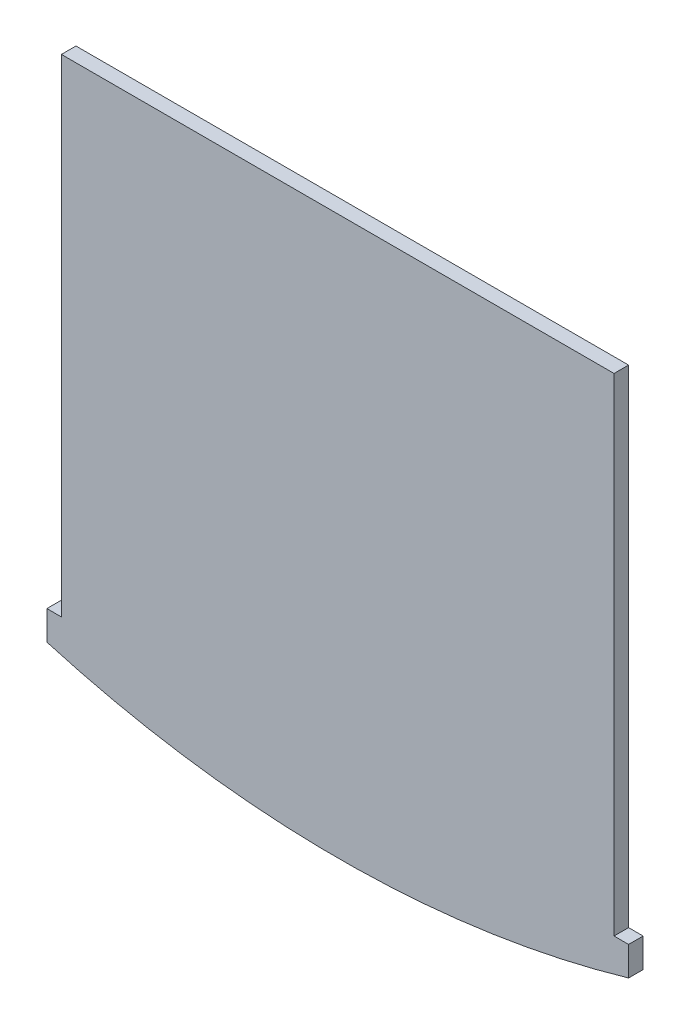
ISO-10303-21;
HEADER;
FILE_DESCRIPTION(('STEP AP214'),'2;1');
FILE_NAME('part.step','',(''),(''),'','','');
FILE_SCHEMA(('AUTOMOTIVE_DESIGN { 1 0 10303 214 1 1 1 1 }'));
ENDSEC;
DATA;
#1=APPLICATION_CONTEXT('core data for automotive mechanical design processes');
#2=APPLICATION_PROTOCOL_DEFINITION('international standard','automotive_design',2000,#1);
#3=PRODUCT_CONTEXT('',#1,'mechanical');
#4=PRODUCT('Part','Part','',(#3));
#5=PRODUCT_RELATED_PRODUCT_CATEGORY('part','',(#4));
#6=PRODUCT_DEFINITION_FORMATION('','',#4);
#7=PRODUCT_DEFINITION_CONTEXT('part definition',#1,'design');
#8=PRODUCT_DEFINITION('design','',#6,#7);
#9=PRODUCT_DEFINITION_SHAPE('','',#8);
#10=(LENGTH_UNIT() NAMED_UNIT(*) SI_UNIT(.MILLI.,.METRE.));
#11=(NAMED_UNIT(*) PLANE_ANGLE_UNIT() SI_UNIT($,.RADIAN.));
#12=(NAMED_UNIT(*) SI_UNIT($,.STERADIAN.) SOLID_ANGLE_UNIT());
#13=UNCERTAINTY_MEASURE_WITH_UNIT(LENGTH_MEASURE(1.E-05),#10,'distance_accuracy_value','');
#14=(GEOMETRIC_REPRESENTATION_CONTEXT(3) GLOBAL_UNCERTAINTY_ASSIGNED_CONTEXT((#13)) GLOBAL_UNIT_ASSIGNED_CONTEXT((#10,
#11,#12)) REPRESENTATION_CONTEXT('',''));
#15=CARTESIAN_POINT('',(0.,0.,0.));
#16=DIRECTION('',(0.,0.,1.));
#17=DIRECTION('',(1.,0.,0.));
#18=AXIS2_PLACEMENT_3D('',#15,#16,#17);
#19=CARTESIAN_POINT('',(-40.0000000000005,-67.,2.));
#20=DIRECTION('',(1.,0.,0.));
#21=DIRECTION('',(0.,0.,-1.));
#22=AXIS2_PLACEMENT_3D('',#19,#20,#21);
#23=PLANE('',#22);
#24=DIRECTION('',(0.,-1.,0.));
#25=VECTOR('',#24,1.);
#26=CARTESIAN_POINT('',(-40.0000000000005,-67.,0.));
#27=LINE('',#26,#25);
#28=CARTESIAN_POINT('',(-40.0000000000005,-67.,0.));
#29=VERTEX_POINT('',#28);
#30=CARTESIAN_POINT('',(-40.0000000000005,-70.9999999999999,0.));
#31=VERTEX_POINT('',#30);
#32=EDGE_CURVE('E140',#29,#31,#27,.T.);
#33=ORIENTED_EDGE('',*,*,#32,.T.);
#34=DIRECTION('',(0.,0.,-1.));
#35=VECTOR('',#34,1.);
#36=CARTESIAN_POINT('',(-40.0000000000005,-70.9999999999999,2.));
#37=LINE('',#36,#35);
#38=CARTESIAN_POINT('',(-40.0000000000005,-70.9999999999999,2.));
#39=VERTEX_POINT('',#38);
#40=EDGE_CURVE('E11',#39,#31,#37,.T.);
#41=ORIENTED_EDGE('',*,*,#40,.F.);
#42=DIRECTION('',(0.,-1.,0.));
#43=VECTOR('',#42,1.);
#44=CARTESIAN_POINT('',(-40.0000000000005,-67.,2.));
#45=LINE('',#44,#43);
#46=CARTESIAN_POINT('',(-40.0000000000005,-67.,2.));
#47=VERTEX_POINT('',#46);
#48=EDGE_CURVE('E162',#47,#39,#45,.T.);
#49=ORIENTED_EDGE('',*,*,#48,.F.);
#50=DIRECTION('',(0.,0.,-1.));
#51=VECTOR('',#50,1.);
#52=CARTESIAN_POINT('',(-40.0000000000005,-67.,2.));
#53=LINE('',#52,#51);
#54=EDGE_CURVE('E136',#47,#29,#53,.T.);
#55=ORIENTED_EDGE('',*,*,#54,.T.);
#56=EDGE_LOOP('',(#33,#41,#49,#55));
#57=FACE_BOUND('',#56,.T.);
#58=ADVANCED_FACE('F39',(#57),#23,.F.);
#59=CARTESIAN_POINT('',(0.,66.2916603439556,2.));
#60=DIRECTION('',(0.,0.,-1.));
#61=DIRECTION('',(-1.,0.,0.));
#62=AXIS2_PLACEMENT_3D('',#59,#60,#61);
#63=CYLINDRICAL_SURFACE('',#62,143.);
#64=CARTESIAN_POINT('',(0.,66.2916603439556,0.));
#65=DIRECTION('',(0.,0.,1.));
#66=DIRECTION('',(1.,0.,0.));
#67=AXIS2_PLACEMENT_3D('',#64,#65,#66);
#68=CIRCLE('',#67,143.);
#69=CARTESIAN_POINT('',(39.9999999999995,-71.,0.));
#70=VERTEX_POINT('',#69);
#71=EDGE_CURVE('E144',#31,#70,#68,.T.);
#72=ORIENTED_EDGE('',*,*,#71,.T.);
#73=DIRECTION('',(0.,0.,-1.));
#74=VECTOR('',#73,1.);
#75=CARTESIAN_POINT('',(39.9999999999995,-71.,2.));
#76=LINE('',#75,#74);
#77=CARTESIAN_POINT('',(39.9999999999995,-71.,2.));
#78=VERTEX_POINT('',#77);
#79=EDGE_CURVE('E48',#78,#70,#76,.T.);
#80=ORIENTED_EDGE('',*,*,#79,.F.);
#81=CARTESIAN_POINT('',(0.,66.2916603439556,2.));
#82=DIRECTION('',(0.,0.,1.));
#83=DIRECTION('',(1.,0.,0.));
#84=AXIS2_PLACEMENT_3D('',#81,#82,#83);
#85=CIRCLE('',#84,143.);
#86=EDGE_CURVE('E99',#39,#78,#85,.T.);
#87=ORIENTED_EDGE('',*,*,#86,.F.);
#88=ORIENTED_EDGE('',*,*,#40,.T.);
#89=EDGE_LOOP('',(#72,#80,#87,#88));
#90=FACE_BOUND('',#89,.T.);
#91=ADVANCED_FACE('F208',(#90),#63,.T.);
#92=CARTESIAN_POINT('',(39.9999999999995,-67.,2.));
#93=DIRECTION('',(-1.,0.,0.));
#94=DIRECTION('',(0.,-1.,0.));
#95=AXIS2_PLACEMENT_3D('',#92,#93,#94);
#96=PLANE('',#95);
#97=DIRECTION('',(0.,1.,0.));
#98=VECTOR('',#97,1.);
#99=CARTESIAN_POINT('',(39.9999999999995,-67.,0.));
#100=LINE('',#99,#98);
#101=CARTESIAN_POINT('',(39.9999999999995,-67.,0.));
#102=VERTEX_POINT('',#101);
#103=EDGE_CURVE('E147',#70,#102,#100,.T.);
#104=ORIENTED_EDGE('',*,*,#103,.T.);
#105=DIRECTION('',(0.,0.,-1.));
#106=VECTOR('',#105,1.);
#107=CARTESIAN_POINT('',(39.9999999999995,-67.,2.));
#108=LINE('',#107,#106);
#109=CARTESIAN_POINT('',(39.9999999999995,-67.,2.));
#110=VERTEX_POINT('',#109);
#111=EDGE_CURVE('E173',#110,#102,#108,.T.);
#112=ORIENTED_EDGE('',*,*,#111,.F.);
#113=DIRECTION('',(0.,1.,0.));
#114=VECTOR('',#113,1.);
#115=CARTESIAN_POINT('',(39.9999999999995,-67.,2.));
#116=LINE('',#115,#114);
#117=EDGE_CURVE('E183',#78,#110,#116,.T.);
#118=ORIENTED_EDGE('',*,*,#117,.F.);
#119=ORIENTED_EDGE('',*,*,#79,.T.);
#120=EDGE_LOOP('',(#104,#112,#118,#119));
#121=FACE_BOUND('',#120,.T.);
#122=ADVANCED_FACE('F181',(#121),#96,.F.);
#123=CARTESIAN_POINT('',(37.9999999999995,-67.,2.));
#124=DIRECTION('',(0.,-1.,0.));
#125=DIRECTION('',(1.,0.,0.));
#126=AXIS2_PLACEMENT_3D('',#123,#124,#125);
#127=PLANE('',#126);
#128=DIRECTION('',(-1.,0.,0.));
#129=VECTOR('',#128,1.);
#130=CARTESIAN_POINT('',(37.9999999999995,-67.,0.));
#131=LINE('',#130,#129);
#132=CARTESIAN_POINT('',(37.9999999999995,-67.,0.));
#133=VERTEX_POINT('',#132);
#134=EDGE_CURVE('E150',#102,#133,#131,.T.);
#135=ORIENTED_EDGE('',*,*,#134,.T.);
#136=DIRECTION('',(0.,0.,-1.));
#137=VECTOR('',#136,1.);
#138=CARTESIAN_POINT('',(37.9999999999995,-67.,2.));
#139=LINE('',#138,#137);
#140=CARTESIAN_POINT('',(37.9999999999995,-67.,2.));
#141=VERTEX_POINT('',#140);
#142=EDGE_CURVE('E169',#141,#133,#139,.T.);
#143=ORIENTED_EDGE('',*,*,#142,.F.);
#144=DIRECTION('',(-1.,0.,0.));
#145=VECTOR('',#144,1.);
#146=CARTESIAN_POINT('',(37.9999999999995,-67.,2.));
#147=LINE('',#146,#145);
#148=EDGE_CURVE('E196',#110,#141,#147,.T.);
#149=ORIENTED_EDGE('',*,*,#148,.F.);
#150=ORIENTED_EDGE('',*,*,#111,.T.);
#151=EDGE_LOOP('',(#135,#143,#149,#150));
#152=FACE_BOUND('',#151,.T.);
#153=ADVANCED_FACE('F191',(#152),#127,.F.);
#154=CARTESIAN_POINT('',(37.9999999999995,0.,2.));
#155=DIRECTION('',(-1.,0.,0.));
#156=DIRECTION('',(0.,-1.,0.));
#157=AXIS2_PLACEMENT_3D('',#154,#155,#156);
#158=PLANE('',#157);
#159=DIRECTION('',(0.,1.,0.));
#160=VECTOR('',#159,1.);
#161=CARTESIAN_POINT('',(37.9999999999995,0.,0.));
#162=LINE('',#161,#160);
#163=CARTESIAN_POINT('',(37.9999999999995,0.,0.));
#164=VERTEX_POINT('',#163);
#165=EDGE_CURVE('E153',#133,#164,#162,.T.);
#166=ORIENTED_EDGE('',*,*,#165,.T.);
#167=DIRECTION('',(0.,0.,-1.));
#168=VECTOR('',#167,1.);
#169=CARTESIAN_POINT('',(37.9999999999995,0.,2.));
#170=LINE('',#169,#168);
#171=CARTESIAN_POINT('',(37.9999999999995,0.,2.));
#172=VERTEX_POINT('',#171);
#173=EDGE_CURVE('E129',#172,#164,#170,.T.);
#174=ORIENTED_EDGE('',*,*,#173,.F.);
#175=DIRECTION('',(0.,1.,0.));
#176=VECTOR('',#175,1.);
#177=CARTESIAN_POINT('',(37.9999999999995,0.,2.));
#178=LINE('',#177,#176);
#179=EDGE_CURVE('E118',#141,#172,#178,.T.);
#180=ORIENTED_EDGE('',*,*,#179,.F.);
#181=ORIENTED_EDGE('',*,*,#142,.T.);
#182=EDGE_LOOP('',(#166,#174,#180,#181));
#183=FACE_BOUND('',#182,.T.);
#184=ADVANCED_FACE('F194',(#183),#158,.F.);
#185=CARTESIAN_POINT('',(37.9999999999995,0.,2.));
#186=DIRECTION('',(0.,-1.,0.));
#187=DIRECTION('',(1.,0.,0.));
#188=AXIS2_PLACEMENT_3D('',#185,#186,#187);
#189=PLANE('',#188);
#190=DIRECTION('',(-1.,0.,0.));
#191=VECTOR('',#190,1.);
#192=CARTESIAN_POINT('',(37.9999999999995,0.,0.));
#193=LINE('',#192,#191);
#194=CARTESIAN_POINT('',(-38.0000000000005,0.,0.));
#195=VERTEX_POINT('',#194);
#196=EDGE_CURVE('E127',#164,#195,#193,.T.);
#197=ORIENTED_EDGE('',*,*,#196,.T.);
#198=DIRECTION('',(0.,0.,-1.));
#199=VECTOR('',#198,1.);
#200=CARTESIAN_POINT('',(-38.0000000000005,0.,2.));
#201=LINE('',#200,#199);
#202=CARTESIAN_POINT('',(-38.0000000000005,0.,2.));
#203=VERTEX_POINT('',#202);
#204=EDGE_CURVE('E124',#203,#195,#201,.T.);
#205=ORIENTED_EDGE('',*,*,#204,.F.);
#206=DIRECTION('',(-1.,0.,0.));
#207=VECTOR('',#206,1.);
#208=CARTESIAN_POINT('',(37.9999999999995,0.,2.));
#209=LINE('',#208,#207);
#210=EDGE_CURVE('E112',#172,#203,#209,.T.);
#211=ORIENTED_EDGE('',*,*,#210,.F.);
#212=ORIENTED_EDGE('',*,*,#173,.T.);
#213=EDGE_LOOP('',(#197,#205,#211,#212));
#214=FACE_BOUND('',#213,.T.);
#215=ADVANCED_FACE('F125',(#214),#189,.F.);
#216=CARTESIAN_POINT('',(-38.0000000000005,0.,2.));
#217=DIRECTION('',(1.,0.,0.));
#218=DIRECTION('',(0.,1.,0.));
#219=AXIS2_PLACEMENT_3D('',#216,#217,#218);
#220=PLANE('',#219);
#221=DIRECTION('',(0.,-1.,0.));
#222=VECTOR('',#221,1.);
#223=CARTESIAN_POINT('',(-38.0000000000005,0.,0.));
#224=LINE('',#223,#222);
#225=CARTESIAN_POINT('',(-38.0000000000005,-67.,0.));
#226=VERTEX_POINT('',#225);
#227=EDGE_CURVE('E85',#195,#226,#224,.T.);
#228=ORIENTED_EDGE('',*,*,#227,.T.);
#229=DIRECTION('',(0.,0.,-1.));
#230=VECTOR('',#229,1.);
#231=CARTESIAN_POINT('',(-38.0000000000005,-67.,2.));
#232=LINE('',#231,#230);
#233=CARTESIAN_POINT('',(-38.0000000000005,-67.,2.));
#234=VERTEX_POINT('',#233);
#235=EDGE_CURVE('E130',#234,#226,#232,.T.);
#236=ORIENTED_EDGE('',*,*,#235,.F.);
#237=DIRECTION('',(0.,-1.,0.));
#238=VECTOR('',#237,1.);
#239=CARTESIAN_POINT('',(-38.0000000000005,0.,2.));
#240=LINE('',#239,#238);
#241=EDGE_CURVE('E116',#203,#234,#240,.T.);
#242=ORIENTED_EDGE('',*,*,#241,.F.);
#243=ORIENTED_EDGE('',*,*,#204,.T.);
#244=EDGE_LOOP('',(#228,#236,#242,#243));
#245=FACE_BOUND('',#244,.T.);
#246=ADVANCED_FACE('F132',(#245),#220,.F.);
#247=CARTESIAN_POINT('',(-40.0000000000005,-67.,2.));
#248=DIRECTION('',(0.,-1.,0.));
#249=DIRECTION('',(0.,0.,-1.));
#250=AXIS2_PLACEMENT_3D('',#247,#248,#249);
#251=PLANE('',#250);
#252=DIRECTION('',(-1.,0.,0.));
#253=VECTOR('',#252,1.);
#254=CARTESIAN_POINT('',(-40.0000000000005,-67.,0.));
#255=LINE('',#254,#253);
#256=EDGE_CURVE('E91',#226,#29,#255,.T.);
#257=ORIENTED_EDGE('',*,*,#256,.T.);
#258=ORIENTED_EDGE('',*,*,#54,.F.);
#259=DIRECTION('',(-1.,0.,0.));
#260=VECTOR('',#259,1.);
#261=CARTESIAN_POINT('',(-40.0000000000005,-67.,2.));
#262=LINE('',#261,#260);
#263=EDGE_CURVE('E56',#234,#47,#262,.T.);
#264=ORIENTED_EDGE('',*,*,#263,.F.);
#265=ORIENTED_EDGE('',*,*,#235,.T.);
#266=EDGE_LOOP('',(#257,#258,#264,#265));
#267=FACE_BOUND('',#266,.T.);
#268=ADVANCED_FACE('F224',(#267),#251,.F.);
#269=CARTESIAN_POINT('',(0.,66.2916603439556,2.));
#270=DIRECTION('',(0.,0.,1.));
#271=DIRECTION('',(1.,0.,0.));
#272=AXIS2_PLACEMENT_3D('',#269,#270,#271);
#273=PLANE('',#272);
#274=ORIENTED_EDGE('',*,*,#48,.T.);
#275=ORIENTED_EDGE('',*,*,#86,.T.);
#276=ORIENTED_EDGE('',*,*,#117,.T.);
#277=ORIENTED_EDGE('',*,*,#148,.T.);
#278=ORIENTED_EDGE('',*,*,#179,.T.);
#279=ORIENTED_EDGE('',*,*,#210,.T.);
#280=ORIENTED_EDGE('',*,*,#241,.T.);
#281=ORIENTED_EDGE('',*,*,#263,.T.);
#282=EDGE_LOOP('',(#274,#275,#276,#277,#278,#279,#280,#281));
#283=FACE_BOUND('',#282,.T.);
#284=ADVANCED_FACE('F114',(#283),#273,.T.);
#285=CARTESIAN_POINT('',(0.,66.2916603439556,0.));
#286=DIRECTION('',(0.,0.,1.));
#287=DIRECTION('',(1.,0.,0.));
#288=AXIS2_PLACEMENT_3D('',#285,#286,#287);
#289=PLANE('',#288);
#290=ORIENTED_EDGE('',*,*,#32,.F.);
#291=ORIENTED_EDGE('',*,*,#256,.F.);
#292=ORIENTED_EDGE('',*,*,#227,.F.);
#293=ORIENTED_EDGE('',*,*,#196,.F.);
#294=ORIENTED_EDGE('',*,*,#165,.F.);
#295=ORIENTED_EDGE('',*,*,#134,.F.);
#296=ORIENTED_EDGE('',*,*,#103,.F.);
#297=ORIENTED_EDGE('',*,*,#71,.F.);
#298=EDGE_LOOP('',(#290,#291,#292,#293,#294,#295,#296,#297));
#299=FACE_BOUND('',#298,.T.);
#300=ADVANCED_FACE('F187',(#299),#289,.F.);
#301=CLOSED_SHELL('',(#58,#91,#122,#153,#184,#215,#246,#268,#284,#300));
#302=MANIFOLD_SOLID_BREP('B2',#301);
#303=ADVANCED_BREP_SHAPE_REPRESENTATION('',(#18,#302),#14);
#304=SHAPE_DEFINITION_REPRESENTATION(#9,#303);
ENDSEC;
END-ISO-10303-21;
